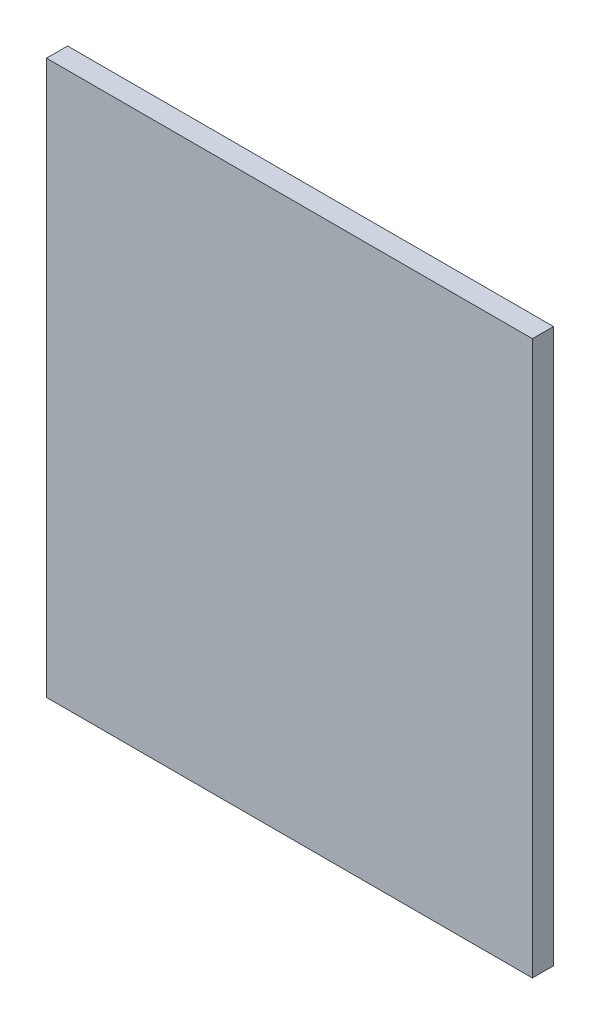
ISO-10303-21;
HEADER;
FILE_DESCRIPTION(('STEP AP214'),'2;1');
FILE_NAME('part.step','',(''),(''),'','','');
FILE_SCHEMA(('AUTOMOTIVE_DESIGN { 1 0 10303 214 1 1 1 1 }'));
ENDSEC;
DATA;
#1=APPLICATION_CONTEXT('core data for automotive mechanical design processes');
#2=APPLICATION_PROTOCOL_DEFINITION('international standard','automotive_design',2000,#1);
#3=PRODUCT_CONTEXT('',#1,'mechanical');
#4=PRODUCT('Part','Part','',(#3));
#5=PRODUCT_RELATED_PRODUCT_CATEGORY('part','',(#4));
#6=PRODUCT_DEFINITION_FORMATION('','',#4);
#7=PRODUCT_DEFINITION_CONTEXT('part definition',#1,'design');
#8=PRODUCT_DEFINITION('design','',#6,#7);
#9=PRODUCT_DEFINITION_SHAPE('','',#8);
#10=(LENGTH_UNIT() NAMED_UNIT(*) SI_UNIT(.MILLI.,.METRE.));
#11=(NAMED_UNIT(*) PLANE_ANGLE_UNIT() SI_UNIT($,.RADIAN.));
#12=(NAMED_UNIT(*) SI_UNIT($,.STERADIAN.) SOLID_ANGLE_UNIT());
#13=UNCERTAINTY_MEASURE_WITH_UNIT(LENGTH_MEASURE(1.E-05),#10,'distance_accuracy_value','');
#14=(GEOMETRIC_REPRESENTATION_CONTEXT(3) GLOBAL_UNCERTAINTY_ASSIGNED_CONTEXT((#13)) GLOBAL_UNIT_ASSIGNED_CONTEXT((#10,
#11,#12)) REPRESENTATION_CONTEXT('',''));
#15=CARTESIAN_POINT('',(0.,0.,0.));
#16=DIRECTION('',(0.,0.,1.));
#17=DIRECTION('',(1.,0.,0.));
#18=AXIS2_PLACEMENT_3D('',#15,#16,#17);
#19=CARTESIAN_POINT('',(0.800000000000002,0.,-2.));
#20=DIRECTION('',(0.,0.,1.));
#21=DIRECTION('',(1.,0.,0.));
#22=AXIS2_PLACEMENT_3D('',#19,#20,#21);
#23=PLANE('',#22);
#24=DIRECTION('',(0.,1.,0.));
#25=VECTOR('',#24,1.);
#26=CARTESIAN_POINT('',(54.1,62.5,-1.99999999999999));
#27=LINE('',#26,#25);
#28=CARTESIAN_POINT('',(54.1,-62.5,-2.));
#29=VERTEX_POINT('',#28);
#30=CARTESIAN_POINT('',(54.1,62.5,-2.));
#31=VERTEX_POINT('',#30);
#32=EDGE_CURVE('E20',#29,#31,#27,.T.);
#33=ORIENTED_EDGE('',*,*,#32,.F.);
#34=DIRECTION('',(1.,0.,0.));
#35=VECTOR('',#34,1.);
#36=CARTESIAN_POINT('',(54.1,-62.5,-2.));
#37=LINE('',#36,#35);
#38=CARTESIAN_POINT('',(-55.6,-62.5,-2.));
#39=VERTEX_POINT('',#38);
#40=EDGE_CURVE('E80',#39,#29,#37,.T.);
#41=ORIENTED_EDGE('',*,*,#40,.F.);
#42=DIRECTION('',(0.,1.,0.));
#43=VECTOR('',#42,1.);
#44=CARTESIAN_POINT('',(-55.6,0.,-2.));
#45=LINE('',#44,#43);
#46=CARTESIAN_POINT('',(-55.6,62.5,-2.));
#47=VERTEX_POINT('',#46);
#48=EDGE_CURVE('E55',#39,#47,#45,.T.);
#49=ORIENTED_EDGE('',*,*,#48,.T.);
#50=DIRECTION('',(1.,0.,0.));
#51=VECTOR('',#50,1.);
#52=CARTESIAN_POINT('',(-52.5,62.5,-2.));
#53=LINE('',#52,#51);
#54=EDGE_CURVE('E67',#31,#47,#53,.F.);
#55=ORIENTED_EDGE('',*,*,#54,.F.);
#56=EDGE_LOOP('',(#33,#41,#49,#55));
#57=FACE_BOUND('',#56,.T.);
#58=ADVANCED_FACE('F17',(#57),#23,.F.);
#59=CARTESIAN_POINT('',(54.1,62.5,-2.));
#60=DIRECTION('',(1.,0.,0.));
#61=DIRECTION('',(0.,0.,-1.));
#62=AXIS2_PLACEMENT_3D('',#59,#60,#61);
#63=PLANE('',#62);
#64=ORIENTED_EDGE('',*,*,#32,.T.);
#65=DIRECTION('',(0.,0.,1.));
#66=VECTOR('',#65,1.);
#67=CARTESIAN_POINT('',(54.1,62.5,-2.));
#68=LINE('',#67,#66);
#69=CARTESIAN_POINT('',(54.1,62.5,2.76));
#70=VERTEX_POINT('',#69);
#71=EDGE_CURVE('E62',#70,#31,#68,.F.);
#72=ORIENTED_EDGE('',*,*,#71,.F.);
#73=DIRECTION('',(0.,1.,0.));
#74=VECTOR('',#73,1.);
#75=CARTESIAN_POINT('',(54.1,0.,2.76));
#76=LINE('',#75,#74);
#77=CARTESIAN_POINT('',(54.1,-62.5,2.76));
#78=VERTEX_POINT('',#77);
#79=EDGE_CURVE('E83',#78,#70,#76,.T.);
#80=ORIENTED_EDGE('',*,*,#79,.F.);
#81=DIRECTION('',(0.,0.,-1.));
#82=VECTOR('',#81,1.);
#83=CARTESIAN_POINT('',(54.1,-62.5,-1.99999999999999));
#84=LINE('',#83,#82);
#85=EDGE_CURVE('E65',#29,#78,#84,.F.);
#86=ORIENTED_EDGE('',*,*,#85,.F.);
#87=EDGE_LOOP('',(#64,#72,#80,#86));
#88=FACE_BOUND('',#87,.T.);
#89=ADVANCED_FACE('F60',(#88),#63,.T.);
#90=CARTESIAN_POINT('',(-52.5,62.5,-2.));
#91=DIRECTION('',(0.,1.,0.));
#92=DIRECTION('',(0.,0.,1.));
#93=AXIS2_PLACEMENT_3D('',#90,#91,#92);
#94=PLANE('',#93);
#95=ORIENTED_EDGE('',*,*,#54,.T.);
#96=DIRECTION('',(0.,0.,-1.));
#97=VECTOR('',#96,1.);
#98=CARTESIAN_POINT('',(-55.6,62.5,0.379999999999995));
#99=LINE('',#98,#97);
#100=CARTESIAN_POINT('',(-55.6,62.5,2.75999999999999));
#101=VERTEX_POINT('',#100);
#102=EDGE_CURVE('E77',#47,#101,#99,.F.);
#103=ORIENTED_EDGE('',*,*,#102,.T.);
#104=DIRECTION('',(1.,0.,0.));
#105=VECTOR('',#104,1.);
#106=CARTESIAN_POINT('',(0.,62.5,2.76));
#107=LINE('',#106,#105);
#108=EDGE_CURVE('E73',#70,#101,#107,.F.);
#109=ORIENTED_EDGE('',*,*,#108,.F.);
#110=ORIENTED_EDGE('',*,*,#71,.T.);
#111=EDGE_LOOP('',(#95,#103,#109,#110));
#112=FACE_BOUND('',#111,.T.);
#113=ADVANCED_FACE('F71',(#112),#94,.T.);
#114=CARTESIAN_POINT('',(-55.6,0.,0.379999999999995));
#115=DIRECTION('',(1.,0.,0.));
#116=DIRECTION('',(0.,0.,-1.));
#117=AXIS2_PLACEMENT_3D('',#114,#115,#116);
#118=PLANE('',#117);
#119=ORIENTED_EDGE('',*,*,#102,.F.);
#120=ORIENTED_EDGE('',*,*,#48,.F.);
#121=DIRECTION('',(0.,0.,-1.));
#122=VECTOR('',#121,1.);
#123=CARTESIAN_POINT('',(-55.6,-62.5,-1.99999999999999));
#124=LINE('',#123,#122);
#125=CARTESIAN_POINT('',(-55.6,-62.5,2.76));
#126=VERTEX_POINT('',#125);
#127=EDGE_CURVE('E35',#126,#39,#124,.T.);
#128=ORIENTED_EDGE('',*,*,#127,.F.);
#129=DIRECTION('',(0.,1.,0.));
#130=VECTOR('',#129,1.);
#131=CARTESIAN_POINT('',(-55.6,0.,2.76));
#132=LINE('',#131,#130);
#133=EDGE_CURVE('E26',#101,#126,#132,.F.);
#134=ORIENTED_EDGE('',*,*,#133,.F.);
#135=EDGE_LOOP('',(#119,#120,#128,#134));
#136=FACE_BOUND('',#135,.T.);
#137=ADVANCED_FACE('F89',(#136),#118,.F.);
#138=CARTESIAN_POINT('',(54.1,-62.5,-1.99999999999999));
#139=DIRECTION('',(0.,-1.,0.));
#140=DIRECTION('',(0.,0.,-1.));
#141=AXIS2_PLACEMENT_3D('',#138,#139,#140);
#142=PLANE('',#141);
#143=ORIENTED_EDGE('',*,*,#40,.T.);
#144=ORIENTED_EDGE('',*,*,#85,.T.);
#145=DIRECTION('',(1.,0.,0.));
#146=VECTOR('',#145,1.);
#147=CARTESIAN_POINT('',(0.,-62.5,2.76));
#148=LINE('',#147,#146);
#149=EDGE_CURVE('E11',#126,#78,#148,.T.);
#150=ORIENTED_EDGE('',*,*,#149,.F.);
#151=ORIENTED_EDGE('',*,*,#127,.T.);
#152=EDGE_LOOP('',(#143,#144,#150,#151));
#153=FACE_BOUND('',#152,.T.);
#154=ADVANCED_FACE('F91',(#153),#142,.T.);
#155=CARTESIAN_POINT('',(0.,0.,2.76));
#156=DIRECTION('',(0.,0.,1.));
#157=DIRECTION('',(1.,0.,0.));
#158=AXIS2_PLACEMENT_3D('',#155,#156,#157);
#159=PLANE('',#158);
#160=ORIENTED_EDGE('',*,*,#133,.T.);
#161=ORIENTED_EDGE('',*,*,#149,.T.);
#162=ORIENTED_EDGE('',*,*,#79,.T.);
#163=ORIENTED_EDGE('',*,*,#108,.T.);
#164=EDGE_LOOP('',(#160,#161,#162,#163));
#165=FACE_BOUND('',#164,.T.);
#166=ADVANCED_FACE('F88',(#165),#159,.T.);
#167=CLOSED_SHELL('',(#58,#89,#113,#137,#154,#166));
#168=MANIFOLD_SOLID_BREP('B1',#167);
#169=ADVANCED_BREP_SHAPE_REPRESENTATION('',(#18,#168),#14);
#170=SHAPE_DEFINITION_REPRESENTATION(#9,#169);
ENDSEC;
END-ISO-10303-21;
